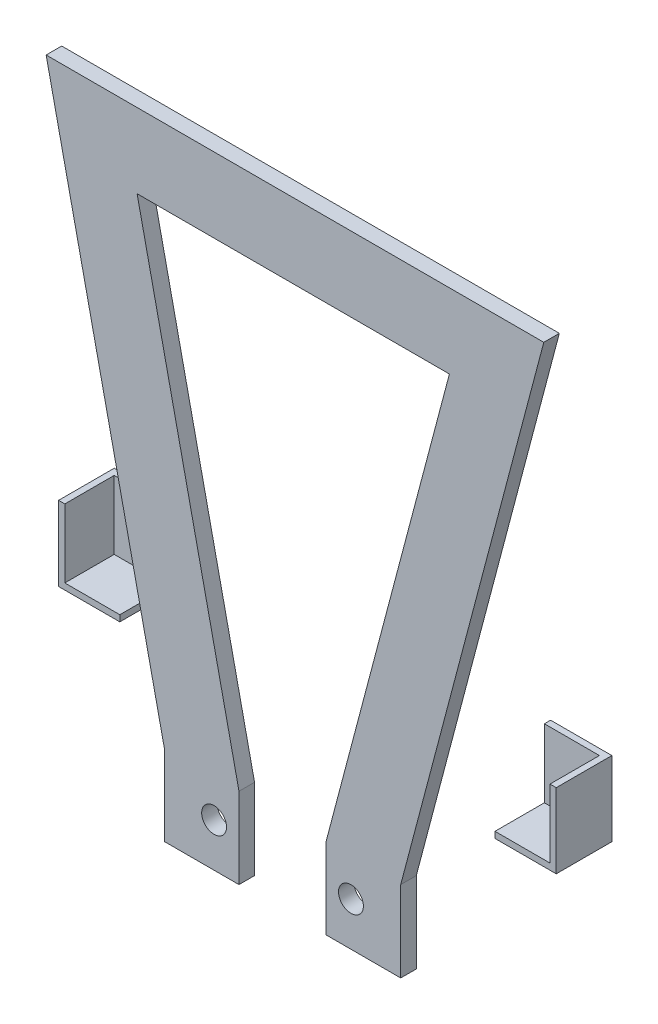
ISO-10303-21;
HEADER;
FILE_DESCRIPTION(('STEP AP214'),'2;1');
FILE_NAME('part.step','',(''),(''),'','','');
FILE_SCHEMA(('AUTOMOTIVE_DESIGN { 1 0 10303 214 1 1 1 1 }'));
ENDSEC;
DATA;
#1=APPLICATION_CONTEXT('core data for automotive mechanical design processes');
#2=APPLICATION_PROTOCOL_DEFINITION('international standard','automotive_design',2000,#1);
#3=PRODUCT_CONTEXT('',#1,'mechanical');
#4=PRODUCT('Part','Part','',(#3));
#5=PRODUCT_RELATED_PRODUCT_CATEGORY('part','',(#4));
#6=PRODUCT_DEFINITION_FORMATION('','',#4);
#7=PRODUCT_DEFINITION_CONTEXT('part definition',#1,'design');
#8=PRODUCT_DEFINITION('design','',#6,#7);
#9=PRODUCT_DEFINITION_SHAPE('','',#8);
#10=(LENGTH_UNIT() NAMED_UNIT(*) SI_UNIT(.MILLI.,.METRE.));
#11=(NAMED_UNIT(*) PLANE_ANGLE_UNIT() SI_UNIT($,.RADIAN.));
#12=(NAMED_UNIT(*) SI_UNIT($,.STERADIAN.) SOLID_ANGLE_UNIT());
#13=UNCERTAINTY_MEASURE_WITH_UNIT(LENGTH_MEASURE(1.E-05),#10,'distance_accuracy_value','');
#14=(GEOMETRIC_REPRESENTATION_CONTEXT(3) GLOBAL_UNCERTAINTY_ASSIGNED_CONTEXT((#13)) GLOBAL_UNIT_ASSIGNED_CONTEXT((#10,
#11,#12)) REPRESENTATION_CONTEXT('',''));
#15=CARTESIAN_POINT('',(0.,0.,0.));
#16=DIRECTION('',(0.,0.,1.));
#17=DIRECTION('',(1.,0.,0.));
#18=AXIS2_PLACEMENT_3D('',#15,#16,#17);
#19=CARTESIAN_POINT('',(-30.1533800378601,-30.,-2.));
#20=DIRECTION('',(1.,0.,0.));
#21=DIRECTION('',(0.,0.,1.));
#22=AXIS2_PLACEMENT_3D('',#19,#20,#21);
#23=PLANE('',#22);
#24=DIRECTION('',(0.,-1.,0.));
#25=VECTOR('',#24,1.);
#26=CARTESIAN_POINT('',(-30.1533800378601,-30.,-2.));
#27=LINE('',#26,#25);
#28=CARTESIAN_POINT('',(-30.1533800378601,-41.,-2.));
#29=VERTEX_POINT('',#28);
#30=CARTESIAN_POINT('',(-30.1533800378601,-42.,-2.));
#31=VERTEX_POINT('',#30);
#32=EDGE_CURVE('E159',#29,#31,#27,.T.);
#33=ORIENTED_EDGE('',*,*,#32,.T.);
#34=DIRECTION('',(0.,0.,-1.));
#35=VECTOR('',#34,1.);
#36=CARTESIAN_POINT('',(-30.1533800378601,-42.,-2.));
#37=LINE('',#36,#35);
#38=CARTESIAN_POINT('',(-30.1533800378601,-42.,-10.9421224629973));
#39=VERTEX_POINT('',#38);
#40=EDGE_CURVE('E153',#31,#39,#37,.T.);
#41=ORIENTED_EDGE('',*,*,#40,.T.);
#42=DIRECTION('',(0.,-1.,0.));
#43=VECTOR('',#42,1.);
#44=CARTESIAN_POINT('',(-30.1533800378601,-30.,-10.9421224629973));
#45=LINE('',#44,#43);
#46=CARTESIAN_POINT('',(-30.1533800378601,-30.,-10.9421224629973));
#47=VERTEX_POINT('',#46);
#48=EDGE_CURVE('E54',#47,#39,#45,.T.);
#49=ORIENTED_EDGE('',*,*,#48,.F.);
#50=DIRECTION('',(0.,0.,-1.));
#51=VECTOR('',#50,1.);
#52=CARTESIAN_POINT('',(-30.1533800378601,-30.,-2.));
#53=LINE('',#52,#51);
#54=CARTESIAN_POINT('',(-30.1533800378601,-30.,-9.9421224629973));
#55=VERTEX_POINT('',#54);
#56=EDGE_CURVE('E145',#55,#47,#53,.T.);
#57=ORIENTED_EDGE('',*,*,#56,.F.);
#58=DIRECTION('',(0.,-1.,0.));
#59=VECTOR('',#58,1.);
#60=CARTESIAN_POINT('',(-30.1533800378601,-30.,-9.9421224629973));
#61=LINE('',#60,#59);
#62=CARTESIAN_POINT('',(-30.1533800378601,-41.,-9.9421224629973));
#63=VERTEX_POINT('',#62);
#64=EDGE_CURVE('E126',#55,#63,#61,.T.);
#65=ORIENTED_EDGE('',*,*,#64,.T.);
#66=DIRECTION('',(0.,0.,-1.));
#67=VECTOR('',#66,1.);
#68=CARTESIAN_POINT('',(-30.1533800378601,-41.,-2.));
#69=LINE('',#68,#67);
#70=EDGE_CURVE('E118',#29,#63,#69,.T.);
#71=ORIENTED_EDGE('',*,*,#70,.F.);
#72=EDGE_LOOP('',(#33,#41,#49,#57,#65,#71));
#73=FACE_BOUND('',#72,.T.);
#74=ADVANCED_FACE('F46',(#73),#23,.T.);
#75=CARTESIAN_POINT('',(-40.,-30.,-2.));
#76=DIRECTION('',(0.,0.,1.));
#77=DIRECTION('',(-1.,0.,0.));
#78=AXIS2_PLACEMENT_3D('',#75,#76,#77);
#79=PLANE('',#78);
#80=DIRECTION('',(0.,-1.,0.));
#81=VECTOR('',#80,1.);
#82=CARTESIAN_POINT('',(-39.,-30.,-2.));
#83=LINE('',#82,#81);
#84=CARTESIAN_POINT('',(-39.,-30.,-2.));
#85=VERTEX_POINT('',#84);
#86=CARTESIAN_POINT('',(-39.,-41.,-2.));
#87=VERTEX_POINT('',#86);
#88=EDGE_CURVE('E131',#85,#87,#83,.T.);
#89=ORIENTED_EDGE('',*,*,#88,.F.);
#90=DIRECTION('',(1.,0.,0.));
#91=VECTOR('',#90,1.);
#92=CARTESIAN_POINT('',(-40.,-30.,-2.));
#93=LINE('',#92,#91);
#94=CARTESIAN_POINT('',(-40.,-30.,-2.));
#95=VERTEX_POINT('',#94);
#96=EDGE_CURVE('E147',#95,#85,#93,.T.);
#97=ORIENTED_EDGE('',*,*,#96,.F.);
#98=DIRECTION('',(0.,-1.,0.));
#99=VECTOR('',#98,1.);
#100=CARTESIAN_POINT('',(-40.,-30.,-2.));
#101=LINE('',#100,#99);
#102=CARTESIAN_POINT('',(-40.,-42.,-2.));
#103=VERTEX_POINT('',#102);
#104=EDGE_CURVE('E149',#95,#103,#101,.T.);
#105=ORIENTED_EDGE('',*,*,#104,.T.);
#106=DIRECTION('',(1.,0.,0.));
#107=VECTOR('',#106,1.);
#108=CARTESIAN_POINT('',(-40.,-42.,-2.));
#109=LINE('',#108,#107);
#110=EDGE_CURVE('E143',#103,#31,#109,.T.);
#111=ORIENTED_EDGE('',*,*,#110,.T.);
#112=ORIENTED_EDGE('',*,*,#32,.F.);
#113=DIRECTION('',(1.,0.,0.));
#114=VECTOR('',#113,1.);
#115=CARTESIAN_POINT('',(-40.,-41.,-2.));
#116=LINE('',#115,#114);
#117=EDGE_CURVE('E136',#87,#29,#116,.T.);
#118=ORIENTED_EDGE('',*,*,#117,.F.);
#119=EDGE_LOOP('',(#89,#97,#105,#111,#112,#118));
#120=FACE_BOUND('',#119,.T.);
#121=ADVANCED_FACE('F173',(#120),#79,.T.);
#122=CARTESIAN_POINT('',(-40.,-30.,-2.));
#123=DIRECTION('',(1.,0.,0.));
#124=DIRECTION('',(0.,0.,1.));
#125=AXIS2_PLACEMENT_3D('',#122,#123,#124);
#126=PLANE('',#125);
#127=DIRECTION('',(0.,0.,-1.));
#128=VECTOR('',#127,1.);
#129=CARTESIAN_POINT('',(-40.,-42.,-2.));
#130=LINE('',#129,#128);
#131=CARTESIAN_POINT('',(-40.,-42.,-10.9421224629973));
#132=VERTEX_POINT('',#131);
#133=EDGE_CURVE('E90',#103,#132,#130,.T.);
#134=ORIENTED_EDGE('',*,*,#133,.F.);
#135=ORIENTED_EDGE('',*,*,#104,.F.);
#136=DIRECTION('',(0.,0.,-1.));
#137=VECTOR('',#136,1.);
#138=CARTESIAN_POINT('',(-40.,-30.,-2.));
#139=LINE('',#138,#137);
#140=CARTESIAN_POINT('',(-40.,-30.,-10.9421224629973));
#141=VERTEX_POINT('',#140);
#142=EDGE_CURVE('E70',#95,#141,#139,.T.);
#143=ORIENTED_EDGE('',*,*,#142,.T.);
#144=DIRECTION('',(0.,-1.,0.));
#145=VECTOR('',#144,1.);
#146=CARTESIAN_POINT('',(-40.,-30.,-10.9421224629973));
#147=LINE('',#146,#145);
#148=EDGE_CURVE('E12',#141,#132,#147,.T.);
#149=ORIENTED_EDGE('',*,*,#148,.T.);
#150=EDGE_LOOP('',(#134,#135,#143,#149));
#151=FACE_BOUND('',#150,.T.);
#152=ADVANCED_FACE('F48',(#151),#126,.F.);
#153=CARTESIAN_POINT('',(-40.,-30.,-10.9421224629973));
#154=DIRECTION('',(0.,0.,1.));
#155=DIRECTION('',(-1.,0.,0.));
#156=AXIS2_PLACEMENT_3D('',#153,#154,#155);
#157=PLANE('',#156);
#158=DIRECTION('',(1.,0.,0.));
#159=VECTOR('',#158,1.);
#160=CARTESIAN_POINT('',(-40.,-42.,-10.9421224629973));
#161=LINE('',#160,#159);
#162=EDGE_CURVE('E151',#132,#39,#161,.T.);
#163=ORIENTED_EDGE('',*,*,#162,.F.);
#164=ORIENTED_EDGE('',*,*,#148,.F.);
#165=DIRECTION('',(1.,0.,0.));
#166=VECTOR('',#165,1.);
#167=CARTESIAN_POINT('',(-40.,-30.,-10.9421224629973));
#168=LINE('',#167,#166);
#169=EDGE_CURVE('E93',#141,#47,#168,.T.);
#170=ORIENTED_EDGE('',*,*,#169,.T.);
#171=ORIENTED_EDGE('',*,*,#48,.T.);
#172=EDGE_LOOP('',(#163,#164,#170,#171));
#173=FACE_BOUND('',#172,.T.);
#174=ADVANCED_FACE('F164',(#173),#157,.F.);
#175=CARTESIAN_POINT('',(0.,-30.,0.));
#176=DIRECTION('',(0.,1.,0.));
#177=DIRECTION('',(0.,0.,1.));
#178=AXIS2_PLACEMENT_3D('',#175,#176,#177);
#179=PLANE('',#178);
#180=DIRECTION('',(0.,0.,-1.));
#181=VECTOR('',#180,1.);
#182=CARTESIAN_POINT('',(-39.,-30.,-2.));
#183=LINE('',#182,#181);
#184=CARTESIAN_POINT('',(-39.,-30.,-9.9421224629973));
#185=VERTEX_POINT('',#184);
#186=EDGE_CURVE('E134',#85,#185,#183,.T.);
#187=ORIENTED_EDGE('',*,*,#186,.T.);
#188=DIRECTION('',(1.,0.,0.));
#189=VECTOR('',#188,1.);
#190=CARTESIAN_POINT('',(-40.,-30.,-9.9421224629973));
#191=LINE('',#190,#189);
#192=EDGE_CURVE('E124',#185,#55,#191,.T.);
#193=ORIENTED_EDGE('',*,*,#192,.T.);
#194=ORIENTED_EDGE('',*,*,#56,.T.);
#195=ORIENTED_EDGE('',*,*,#169,.F.);
#196=ORIENTED_EDGE('',*,*,#142,.F.);
#197=ORIENTED_EDGE('',*,*,#96,.T.);
#198=EDGE_LOOP('',(#187,#193,#194,#195,#196,#197));
#199=FACE_BOUND('',#198,.T.);
#200=ADVANCED_FACE('F179',(#199),#179,.T.);
#201=CARTESIAN_POINT('',(0.,-42.,0.));
#202=DIRECTION('',(0.,1.,0.));
#203=DIRECTION('',(0.,0.,1.));
#204=AXIS2_PLACEMENT_3D('',#201,#202,#203);
#205=PLANE('',#204);
#206=ORIENTED_EDGE('',*,*,#133,.T.);
#207=ORIENTED_EDGE('',*,*,#162,.T.);
#208=ORIENTED_EDGE('',*,*,#40,.F.);
#209=ORIENTED_EDGE('',*,*,#110,.F.);
#210=EDGE_LOOP('',(#206,#207,#208,#209));
#211=FACE_BOUND('',#210,.T.);
#212=ADVANCED_FACE('F170',(#211),#205,.F.);
#213=CARTESIAN_POINT('',(-39.,-30.,-2.));
#214=DIRECTION('',(1.,0.,0.));
#215=DIRECTION('',(0.,0.,1.));
#216=AXIS2_PLACEMENT_3D('',#213,#214,#215);
#217=PLANE('',#216);
#218=DIRECTION('',(0.,0.,-1.));
#219=VECTOR('',#218,1.);
#220=CARTESIAN_POINT('',(-39.,-41.,-2.));
#221=LINE('',#220,#219);
#222=CARTESIAN_POINT('',(-39.,-41.,-9.9421224629973));
#223=VERTEX_POINT('',#222);
#224=EDGE_CURVE('E115',#87,#223,#221,.T.);
#225=ORIENTED_EDGE('',*,*,#224,.T.);
#226=DIRECTION('',(0.,-1.,0.));
#227=VECTOR('',#226,1.);
#228=CARTESIAN_POINT('',(-39.,-30.,-9.9421224629973));
#229=LINE('',#228,#227);
#230=EDGE_CURVE('E61',#185,#223,#229,.T.);
#231=ORIENTED_EDGE('',*,*,#230,.F.);
#232=ORIENTED_EDGE('',*,*,#186,.F.);
#233=ORIENTED_EDGE('',*,*,#88,.T.);
#234=EDGE_LOOP('',(#225,#231,#232,#233));
#235=FACE_BOUND('',#234,.T.);
#236=ADVANCED_FACE('F129',(#235),#217,.T.);
#237=CARTESIAN_POINT('',(-40.,-30.,-9.9421224629973));
#238=DIRECTION('',(0.,0.,1.));
#239=DIRECTION('',(-1.,0.,0.));
#240=AXIS2_PLACEMENT_3D('',#237,#238,#239);
#241=PLANE('',#240);
#242=DIRECTION('',(1.,0.,0.));
#243=VECTOR('',#242,1.);
#244=CARTESIAN_POINT('',(-40.,-41.,-9.9421224629973));
#245=LINE('',#244,#243);
#246=EDGE_CURVE('E113',#223,#63,#245,.T.);
#247=ORIENTED_EDGE('',*,*,#246,.T.);
#248=ORIENTED_EDGE('',*,*,#64,.F.);
#249=ORIENTED_EDGE('',*,*,#192,.F.);
#250=ORIENTED_EDGE('',*,*,#230,.T.);
#251=EDGE_LOOP('',(#247,#248,#249,#250));
#252=FACE_BOUND('',#251,.T.);
#253=ADVANCED_FACE('F123',(#252),#241,.T.);
#254=CARTESIAN_POINT('',(0.,-41.,0.));
#255=DIRECTION('',(0.,1.,0.));
#256=DIRECTION('',(0.,0.,1.));
#257=AXIS2_PLACEMENT_3D('',#254,#255,#256);
#258=PLANE('',#257);
#259=ORIENTED_EDGE('',*,*,#224,.F.);
#260=ORIENTED_EDGE('',*,*,#117,.T.);
#261=ORIENTED_EDGE('',*,*,#70,.T.);
#262=ORIENTED_EDGE('',*,*,#246,.F.);
#263=EDGE_LOOP('',(#259,#260,#261,#262));
#264=FACE_BOUND('',#263,.T.);
#265=ADVANCED_FACE('F114',(#264),#258,.T.);
#266=CLOSED_SHELL('',(#74,#121,#152,#174,#200,#212,#236,#253,#265));
#267=MANIFOLD_SOLID_BREP('B2',#266);
#268=CARTESIAN_POINT('',(30.1533800378601,-30.,-2.));
#269=DIRECTION('',(-1.,0.,0.));
#270=DIRECTION('',(0.,0.,1.));
#271=AXIS2_PLACEMENT_3D('',#268,#269,#270);
#272=PLANE('',#271);
#273=DIRECTION('',(0.,-1.,0.));
#274=VECTOR('',#273,1.);
#275=CARTESIAN_POINT('',(30.1533800378601,-30.,-2.));
#276=LINE('',#275,#274);
#277=CARTESIAN_POINT('',(30.1533800378601,-41.,-2.));
#278=VERTEX_POINT('',#277);
#279=CARTESIAN_POINT('',(30.1533800378601,-42.,-2.));
#280=VERTEX_POINT('',#279);
#281=EDGE_CURVE('E373',#278,#280,#276,.T.);
#282=ORIENTED_EDGE('',*,*,#281,.F.);
#283=DIRECTION('',(0.,0.,-1.));
#284=VECTOR('',#283,1.);
#285=CARTESIAN_POINT('',(30.1533800378601,-41.,-2.));
#286=LINE('',#285,#284);
#287=CARTESIAN_POINT('',(30.1533800378601,-41.,-9.9421224629973));
#288=VERTEX_POINT('',#287);
#289=EDGE_CURVE('E330',#278,#288,#286,.T.);
#290=ORIENTED_EDGE('',*,*,#289,.T.);
#291=DIRECTION('',(0.,-1.,0.));
#292=VECTOR('',#291,1.);
#293=CARTESIAN_POINT('',(30.1533800378601,-30.,-9.9421224629973));
#294=LINE('',#293,#292);
#295=CARTESIAN_POINT('',(30.1533800378601,-30.,-9.9421224629973));
#296=VERTEX_POINT('',#295);
#297=EDGE_CURVE('E326',#296,#288,#294,.T.);
#298=ORIENTED_EDGE('',*,*,#297,.F.);
#299=DIRECTION('',(0.,0.,-1.));
#300=VECTOR('',#299,1.);
#301=CARTESIAN_POINT('',(30.1533800378601,-30.,-2.));
#302=LINE('',#301,#300);
#303=CARTESIAN_POINT('',(30.1533800378601,-30.,-10.9421224629973));
#304=VERTEX_POINT('',#303);
#305=EDGE_CURVE('E359',#296,#304,#302,.T.);
#306=ORIENTED_EDGE('',*,*,#305,.T.);
#307=DIRECTION('',(0.,-1.,0.));
#308=VECTOR('',#307,1.);
#309=CARTESIAN_POINT('',(30.1533800378601,-30.,-10.9421224629973));
#310=LINE('',#309,#308);
#311=CARTESIAN_POINT('',(30.1533800378601,-42.,-10.9421224629973));
#312=VERTEX_POINT('',#311);
#313=EDGE_CURVE('E265',#304,#312,#310,.T.);
#314=ORIENTED_EDGE('',*,*,#313,.T.);
#315=DIRECTION('',(0.,0.,-1.));
#316=VECTOR('',#315,1.);
#317=CARTESIAN_POINT('',(30.1533800378601,-42.,-2.));
#318=LINE('',#317,#316);
#319=EDGE_CURVE('E367',#280,#312,#318,.T.);
#320=ORIENTED_EDGE('',*,*,#319,.F.);
#321=EDGE_LOOP('',(#282,#290,#298,#306,#314,#320));
#322=FACE_BOUND('',#321,.T.);
#323=ADVANCED_FACE('F257',(#322),#272,.T.);
#324=CARTESIAN_POINT('',(40.,-30.,-2.));
#325=DIRECTION('',(0.,0.,1.));
#326=DIRECTION('',(1.,0.,0.));
#327=AXIS2_PLACEMENT_3D('',#324,#325,#326);
#328=PLANE('',#327);
#329=DIRECTION('',(0.,-1.,0.));
#330=VECTOR('',#329,1.);
#331=CARTESIAN_POINT('',(39.,-30.,-2.));
#332=LINE('',#331,#330);
#333=CARTESIAN_POINT('',(39.,-30.,-2.));
#334=VERTEX_POINT('',#333);
#335=CARTESIAN_POINT('',(39.,-41.,-2.));
#336=VERTEX_POINT('',#335);
#337=EDGE_CURVE('E350',#334,#336,#332,.T.);
#338=ORIENTED_EDGE('',*,*,#337,.T.);
#339=DIRECTION('',(-1.,0.,0.));
#340=VECTOR('',#339,1.);
#341=CARTESIAN_POINT('',(40.,-41.,-2.));
#342=LINE('',#341,#340);
#343=EDGE_CURVE('E343',#336,#278,#342,.T.);
#344=ORIENTED_EDGE('',*,*,#343,.T.);
#345=ORIENTED_EDGE('',*,*,#281,.T.);
#346=DIRECTION('',(-1.,0.,0.));
#347=VECTOR('',#346,1.);
#348=CARTESIAN_POINT('',(40.,-42.,-2.));
#349=LINE('',#348,#347);
#350=CARTESIAN_POINT('',(40.,-42.,-2.));
#351=VERTEX_POINT('',#350);
#352=EDGE_CURVE('E357',#351,#280,#349,.T.);
#353=ORIENTED_EDGE('',*,*,#352,.F.);
#354=DIRECTION('',(0.,-1.,0.));
#355=VECTOR('',#354,1.);
#356=CARTESIAN_POINT('',(40.,-30.,-2.));
#357=LINE('',#356,#355);
#358=CARTESIAN_POINT('',(40.,-30.,-2.));
#359=VERTEX_POINT('',#358);
#360=EDGE_CURVE('E281',#359,#351,#357,.T.);
#361=ORIENTED_EDGE('',*,*,#360,.F.);
#362=DIRECTION('',(-1.,0.,0.));
#363=VECTOR('',#362,1.);
#364=CARTESIAN_POINT('',(40.,-30.,-2.));
#365=LINE('',#364,#363);
#366=EDGE_CURVE('E361',#359,#334,#365,.T.);
#367=ORIENTED_EDGE('',*,*,#366,.T.);
#368=EDGE_LOOP('',(#338,#344,#345,#353,#361,#367));
#369=FACE_BOUND('',#368,.T.);
#370=ADVANCED_FACE('F382',(#369),#328,.T.);
#371=CARTESIAN_POINT('',(40.,-30.,-2.));
#372=DIRECTION('',(-1.,0.,0.));
#373=DIRECTION('',(0.,0.,1.));
#374=AXIS2_PLACEMENT_3D('',#371,#372,#373);
#375=PLANE('',#374);
#376=DIRECTION('',(0.,0.,-1.));
#377=VECTOR('',#376,1.);
#378=CARTESIAN_POINT('',(40.,-42.,-2.));
#379=LINE('',#378,#377);
#380=CARTESIAN_POINT('',(40.,-42.,-10.9421224629973));
#381=VERTEX_POINT('',#380);
#382=EDGE_CURVE('E339',#351,#381,#379,.T.);
#383=ORIENTED_EDGE('',*,*,#382,.T.);
#384=DIRECTION('',(0.,-1.,0.));
#385=VECTOR('',#384,1.);
#386=CARTESIAN_POINT('',(40.,-30.,-10.9421224629973));
#387=LINE('',#386,#385);
#388=CARTESIAN_POINT('',(40.,-30.,-10.9421224629973));
#389=VERTEX_POINT('',#388);
#390=EDGE_CURVE('E44',#389,#381,#387,.T.);
#391=ORIENTED_EDGE('',*,*,#390,.F.);
#392=DIRECTION('',(0.,0.,-1.));
#393=VECTOR('',#392,1.);
#394=CARTESIAN_POINT('',(40.,-30.,-2.));
#395=LINE('',#394,#393);
#396=EDGE_CURVE('E355',#359,#389,#395,.T.);
#397=ORIENTED_EDGE('',*,*,#396,.F.);
#398=ORIENTED_EDGE('',*,*,#360,.T.);
#399=EDGE_LOOP('',(#383,#391,#397,#398));
#400=FACE_BOUND('',#399,.T.);
#401=ADVANCED_FACE('F259',(#400),#375,.F.);
#402=CARTESIAN_POINT('',(40.,-30.,-10.9421224629973));
#403=DIRECTION('',(0.,0.,1.));
#404=DIRECTION('',(1.,0.,0.));
#405=AXIS2_PLACEMENT_3D('',#402,#403,#404);
#406=PLANE('',#405);
#407=DIRECTION('',(-1.,0.,0.));
#408=VECTOR('',#407,1.);
#409=CARTESIAN_POINT('',(40.,-42.,-10.9421224629973));
#410=LINE('',#409,#408);
#411=EDGE_CURVE('E364',#381,#312,#410,.T.);
#412=ORIENTED_EDGE('',*,*,#411,.T.);
#413=ORIENTED_EDGE('',*,*,#313,.F.);
#414=DIRECTION('',(-1.,0.,0.));
#415=VECTOR('',#414,1.);
#416=CARTESIAN_POINT('',(40.,-30.,-10.9421224629973));
#417=LINE('',#416,#415);
#418=EDGE_CURVE('E305',#389,#304,#417,.T.);
#419=ORIENTED_EDGE('',*,*,#418,.F.);
#420=ORIENTED_EDGE('',*,*,#390,.T.);
#421=EDGE_LOOP('',(#412,#413,#419,#420));
#422=FACE_BOUND('',#421,.T.);
#423=ADVANCED_FACE('F378',(#422),#406,.F.);
#424=CARTESIAN_POINT('',(0.,-30.,0.));
#425=DIRECTION('',(0.,1.,0.));
#426=DIRECTION('',(0.,0.,1.));
#427=AXIS2_PLACEMENT_3D('',#424,#425,#426);
#428=PLANE('',#427);
#429=DIRECTION('',(0.,0.,-1.));
#430=VECTOR('',#429,1.);
#431=CARTESIAN_POINT('',(39.,-30.,-2.));
#432=LINE('',#431,#430);
#433=CARTESIAN_POINT('',(39.,-30.,-9.9421224629973));
#434=VERTEX_POINT('',#433);
#435=EDGE_CURVE('E337',#334,#434,#432,.T.);
#436=ORIENTED_EDGE('',*,*,#435,.F.);
#437=ORIENTED_EDGE('',*,*,#366,.F.);
#438=ORIENTED_EDGE('',*,*,#396,.T.);
#439=ORIENTED_EDGE('',*,*,#418,.T.);
#440=ORIENTED_EDGE('',*,*,#305,.F.);
#441=DIRECTION('',(-1.,0.,0.));
#442=VECTOR('',#441,1.);
#443=CARTESIAN_POINT('',(40.,-30.,-9.9421224629973));
#444=LINE('',#443,#442);
#445=EDGE_CURVE('E348',#434,#296,#444,.T.);
#446=ORIENTED_EDGE('',*,*,#445,.F.);
#447=EDGE_LOOP('',(#436,#437,#438,#439,#440,#446));
#448=FACE_BOUND('',#447,.T.);
#449=ADVANCED_FACE('F384',(#448),#428,.T.);
#450=CARTESIAN_POINT('',(0.,-42.,0.));
#451=DIRECTION('',(0.,1.,0.));
#452=DIRECTION('',(0.,0.,1.));
#453=AXIS2_PLACEMENT_3D('',#450,#451,#452);
#454=PLANE('',#453);
#455=ORIENTED_EDGE('',*,*,#382,.F.);
#456=ORIENTED_EDGE('',*,*,#352,.T.);
#457=ORIENTED_EDGE('',*,*,#319,.T.);
#458=ORIENTED_EDGE('',*,*,#411,.F.);
#459=EDGE_LOOP('',(#455,#456,#457,#458));
#460=FACE_BOUND('',#459,.T.);
#461=ADVANCED_FACE('F381',(#460),#454,.F.);
#462=CARTESIAN_POINT('',(39.,-30.,-2.));
#463=DIRECTION('',(-1.,0.,0.));
#464=DIRECTION('',(0.,0.,1.));
#465=AXIS2_PLACEMENT_3D('',#462,#463,#464);
#466=PLANE('',#465);
#467=DIRECTION('',(0.,0.,-1.));
#468=VECTOR('',#467,1.);
#469=CARTESIAN_POINT('',(39.,-41.,-2.));
#470=LINE('',#469,#468);
#471=CARTESIAN_POINT('',(39.,-41.,-9.9421224629973));
#472=VERTEX_POINT('',#471);
#473=EDGE_CURVE('E331',#336,#472,#470,.T.);
#474=ORIENTED_EDGE('',*,*,#473,.F.);
#475=ORIENTED_EDGE('',*,*,#337,.F.);
#476=ORIENTED_EDGE('',*,*,#435,.T.);
#477=DIRECTION('',(0.,-1.,0.));
#478=VECTOR('',#477,1.);
#479=CARTESIAN_POINT('',(39.,-30.,-9.9421224629973));
#480=LINE('',#479,#478);
#481=EDGE_CURVE('E272',#434,#472,#480,.T.);
#482=ORIENTED_EDGE('',*,*,#481,.T.);
#483=EDGE_LOOP('',(#474,#475,#476,#482));
#484=FACE_BOUND('',#483,.T.);
#485=ADVANCED_FACE('F334',(#484),#466,.T.);
#486=CARTESIAN_POINT('',(40.,-30.,-9.9421224629973));
#487=DIRECTION('',(0.,0.,1.));
#488=DIRECTION('',(1.,0.,0.));
#489=AXIS2_PLACEMENT_3D('',#486,#487,#488);
#490=PLANE('',#489);
#491=DIRECTION('',(-1.,0.,0.));
#492=VECTOR('',#491,1.);
#493=CARTESIAN_POINT('',(40.,-41.,-9.9421224629973));
#494=LINE('',#493,#492);
#495=EDGE_CURVE('E323',#472,#288,#494,.T.);
#496=ORIENTED_EDGE('',*,*,#495,.F.);
#497=ORIENTED_EDGE('',*,*,#481,.F.);
#498=ORIENTED_EDGE('',*,*,#445,.T.);
#499=ORIENTED_EDGE('',*,*,#297,.T.);
#500=EDGE_LOOP('',(#496,#497,#498,#499));
#501=FACE_BOUND('',#500,.T.);
#502=ADVANCED_FACE('F324',(#501),#490,.T.);
#503=CARTESIAN_POINT('',(0.,-41.,0.));
#504=DIRECTION('',(0.,1.,0.));
#505=DIRECTION('',(0.,0.,1.));
#506=AXIS2_PLACEMENT_3D('',#503,#504,#505);
#507=PLANE('',#506);
#508=ORIENTED_EDGE('',*,*,#473,.T.);
#509=ORIENTED_EDGE('',*,*,#495,.T.);
#510=ORIENTED_EDGE('',*,*,#289,.F.);
#511=ORIENTED_EDGE('',*,*,#343,.F.);
#512=EDGE_LOOP('',(#508,#509,#510,#511));
#513=FACE_BOUND('',#512,.T.);
#514=ADVANCED_FACE('F341',(#513),#507,.T.);
#515=CLOSED_SHELL('',(#323,#370,#401,#423,#449,#461,#485,#502,#514));
#516=MANIFOLD_SOLID_BREP('B6',#515);
#517=CARTESIAN_POINT('',(17.,-67.,0.));
#518=DIRECTION('',(0.,-1.,0.));
#519=DIRECTION('',(0.,0.,-1.));
#520=AXIS2_PLACEMENT_3D('',#517,#518,#519);
#521=PLANE('',#520);
#522=DIRECTION('',(0.,0.,1.));
#523=VECTOR('',#522,1.);
#524=CARTESIAN_POINT('',(-9.,-67.,-2.5));
#525=LINE('',#524,#523);
#526=CARTESIAN_POINT('',(-9.,-67.,-2.5));
#527=VERTEX_POINT('',#526);
#528=CARTESIAN_POINT('',(-9.,-67.,0.));
#529=VERTEX_POINT('',#528);
#530=EDGE_CURVE('E622',#527,#529,#525,.T.);
#531=ORIENTED_EDGE('',*,*,#530,.T.);
#532=DIRECTION('',(-1.,0.,0.));
#533=VECTOR('',#532,1.);
#534=CARTESIAN_POINT('',(17.,-67.,0.));
#535=LINE('',#534,#533);
#536=CARTESIAN_POINT('',(-21.,-67.,0.));
#537=VERTEX_POINT('',#536);
#538=EDGE_CURVE('E555',#529,#537,#535,.T.);
#539=ORIENTED_EDGE('',*,*,#538,.T.);
#540=DIRECTION('',(0.,0.,-1.));
#541=VECTOR('',#540,1.);
#542=CARTESIAN_POINT('',(-21.,-67.,0.));
#543=LINE('',#542,#541);
#544=CARTESIAN_POINT('',(-21.,-67.,-2.5));
#545=VERTEX_POINT('',#544);
#546=EDGE_CURVE('E540',#537,#545,#543,.T.);
#547=ORIENTED_EDGE('',*,*,#546,.T.);
#548=DIRECTION('',(-1.,0.,0.));
#549=VECTOR('',#548,1.);
#550=CARTESIAN_POINT('',(17.,-67.,-2.5));
#551=LINE('',#550,#549);
#552=EDGE_CURVE('E567',#527,#545,#551,.T.);
#553=ORIENTED_EDGE('',*,*,#552,.F.);
#554=EDGE_LOOP('',(#531,#539,#547,#553));
#555=FACE_BOUND('',#554,.T.);
#556=ADVANCED_FACE('F459',(#555),#521,.T.);
#557=CARTESIAN_POINT('',(40.,33.,0.));
#558=DIRECTION('',(0.966786030335291,-0.25558711146795,0.));
#559=DIRECTION('',(0.25558711146795,0.966786030335291,0.));
#560=AXIS2_PLACEMENT_3D('',#557,#558,#559);
#561=PLANE('',#560);
#562=DIRECTION('',(-0.25558711146795,-0.966786030335291,0.));
#563=VECTOR('',#562,1.);
#564=CARTESIAN_POINT('',(40.,33.,-2.5));
#565=LINE('',#564,#563);
#566=CARTESIAN_POINT('',(40.,33.,-2.5));
#567=VERTEX_POINT('',#566);
#568=CARTESIAN_POINT('',(17.,-54.,-2.5));
#569=VERTEX_POINT('',#568);
#570=EDGE_CURVE('E560',#567,#569,#565,.T.);
#571=ORIENTED_EDGE('',*,*,#570,.F.);
#572=DIRECTION('',(0.,0.,-1.));
#573=VECTOR('',#572,1.);
#574=CARTESIAN_POINT('',(40.,33.,0.));
#575=LINE('',#574,#573);
#576=CARTESIAN_POINT('',(40.,33.,0.));
#577=VERTEX_POINT('',#576);
#578=EDGE_CURVE('E255',#577,#567,#575,.T.);
#579=ORIENTED_EDGE('',*,*,#578,.F.);
#580=DIRECTION('',(-0.25558711146795,-0.966786030335291,0.));
#581=VECTOR('',#580,1.);
#582=CARTESIAN_POINT('',(40.,33.,0.));
#583=LINE('',#582,#581);
#584=CARTESIAN_POINT('',(17.,-54.,0.));
#585=VERTEX_POINT('',#584);
#586=EDGE_CURVE('E576',#577,#585,#583,.T.);
#587=ORIENTED_EDGE('',*,*,#586,.T.);
#588=DIRECTION('',(0.,0.,-1.));
#589=VECTOR('',#588,1.);
#590=CARTESIAN_POINT('',(17.,-54.,0.));
#591=LINE('',#590,#589);
#592=EDGE_CURVE('E463',#585,#569,#591,.T.);
#593=ORIENTED_EDGE('',*,*,#592,.T.);
#594=EDGE_LOOP('',(#571,#579,#587,#593));
#595=FACE_BOUND('',#594,.T.);
#596=ADVANCED_FACE('F461',(#595),#561,.T.);
#597=CARTESIAN_POINT('',(-40.,33.,0.));
#598=DIRECTION('',(0.,1.,0.));
#599=DIRECTION('',(0.,0.,1.));
#600=AXIS2_PLACEMENT_3D('',#597,#598,#599);
#601=PLANE('',#600);
#602=DIRECTION('',(1.,0.,0.));
#603=VECTOR('',#602,1.);
#604=CARTESIAN_POINT('',(-40.,33.,-2.5));
#605=LINE('',#604,#603);
#606=CARTESIAN_POINT('',(-40.,33.,-2.5));
#607=VERTEX_POINT('',#606);
#608=EDGE_CURVE('E574',#607,#567,#605,.T.);
#609=ORIENTED_EDGE('',*,*,#608,.F.);
#610=DIRECTION('',(0.,0.,-1.));
#611=VECTOR('',#610,1.);
#612=CARTESIAN_POINT('',(-40.,33.,0.));
#613=LINE('',#612,#611);
#614=CARTESIAN_POINT('',(-40.,33.,0.));
#615=VERTEX_POINT('',#614);
#616=EDGE_CURVE('E468',#615,#607,#613,.T.);
#617=ORIENTED_EDGE('',*,*,#616,.F.);
#618=DIRECTION('',(1.,0.,0.));
#619=VECTOR('',#618,1.);
#620=CARTESIAN_POINT('',(-40.,33.,0.));
#621=LINE('',#620,#619);
#622=EDGE_CURVE('E547',#615,#577,#621,.T.);
#623=ORIENTED_EDGE('',*,*,#622,.T.);
#624=ORIENTED_EDGE('',*,*,#578,.T.);
#625=EDGE_LOOP('',(#609,#617,#623,#624));
#626=FACE_BOUND('',#625,.T.);
#627=ADVANCED_FACE('F585',(#626),#601,.T.);
#628=CARTESIAN_POINT('',(-21.,-54.,0.));
#629=DIRECTION('',(-0.97697321911612,-0.213361967393176,0.));
#630=DIRECTION('',(0.213361967393176,-0.97697321911612,0.));
#631=AXIS2_PLACEMENT_3D('',#628,#629,#630);
#632=PLANE('',#631);
#633=DIRECTION('',(-0.213361967393176,0.97697321911612,0.));
#634=VECTOR('',#633,1.);
#635=CARTESIAN_POINT('',(-21.,-54.,-2.5));
#636=LINE('',#635,#634);
#637=CARTESIAN_POINT('',(-21.,-54.,-2.5));
#638=VERTEX_POINT('',#637);
#639=EDGE_CURVE('E535',#638,#607,#636,.T.);
#640=ORIENTED_EDGE('',*,*,#639,.F.);
#641=DIRECTION('',(0.,0.,-1.));
#642=VECTOR('',#641,1.);
#643=CARTESIAN_POINT('',(-21.,-54.,0.));
#644=LINE('',#643,#642);
#645=CARTESIAN_POINT('',(-21.,-54.,0.));
#646=VERTEX_POINT('',#645);
#647=EDGE_CURVE('E529',#646,#638,#644,.T.);
#648=ORIENTED_EDGE('',*,*,#647,.F.);
#649=DIRECTION('',(-0.213361967393176,0.97697321911612,0.));
#650=VECTOR('',#649,1.);
#651=CARTESIAN_POINT('',(-21.,-54.,0.));
#652=LINE('',#651,#650);
#653=EDGE_CURVE('E532',#646,#615,#652,.T.);
#654=ORIENTED_EDGE('',*,*,#653,.T.);
#655=ORIENTED_EDGE('',*,*,#616,.T.);
#656=EDGE_LOOP('',(#640,#648,#654,#655));
#657=FACE_BOUND('',#656,.T.);
#658=ADVANCED_FACE('F531',(#657),#632,.T.);
#659=CARTESIAN_POINT('',(-21.,-67.,0.));
#660=DIRECTION('',(-1.,0.,0.));
#661=DIRECTION('',(0.,0.,1.));
#662=AXIS2_PLACEMENT_3D('',#659,#660,#661);
#663=PLANE('',#662);
#664=DIRECTION('',(0.,1.,0.));
#665=VECTOR('',#664,1.);
#666=CARTESIAN_POINT('',(-21.,-67.,-2.5));
#667=LINE('',#666,#665);
#668=EDGE_CURVE('E571',#545,#638,#667,.T.);
#669=ORIENTED_EDGE('',*,*,#668,.F.);
#670=ORIENTED_EDGE('',*,*,#546,.F.);
#671=DIRECTION('',(0.,1.,0.));
#672=VECTOR('',#671,1.);
#673=CARTESIAN_POINT('',(-21.,-67.,0.));
#674=LINE('',#673,#672);
#675=EDGE_CURVE('E546',#537,#646,#674,.T.);
#676=ORIENTED_EDGE('',*,*,#675,.T.);
#677=ORIENTED_EDGE('',*,*,#647,.T.);
#678=EDGE_LOOP('',(#669,#670,#676,#677));
#679=FACE_BOUND('',#678,.T.);
#680=ADVANCED_FACE('F550',(#679),#663,.T.);
#681=DIRECTION('',(0.,0.,1.));
#682=VECTOR('',#681,1.);
#683=CARTESIAN_POINT('',(5.,-67.,-2.5));
#684=LINE('',#683,#682);
#685=CARTESIAN_POINT('',(5.,-67.,-2.5));
#686=VERTEX_POINT('',#685);
#687=CARTESIAN_POINT('',(5.,-67.,0.));
#688=VERTEX_POINT('',#687);
#689=EDGE_CURVE('E611',#686,#688,#684,.T.);
#690=ORIENTED_EDGE('',*,*,#689,.F.);
#691=CARTESIAN_POINT('',(17.,-67.,-2.5));
#692=VERTEX_POINT('',#691);
#693=EDGE_CURVE('E568',#692,#686,#551,.T.);
#694=ORIENTED_EDGE('',*,*,#693,.F.);
#695=DIRECTION('',(0.,0.,-1.));
#696=VECTOR('',#695,1.);
#697=CARTESIAN_POINT('',(17.,-67.,0.));
#698=LINE('',#697,#696);
#699=CARTESIAN_POINT('',(17.,-67.,0.));
#700=VERTEX_POINT('',#699);
#701=EDGE_CURVE('E579',#700,#692,#698,.T.);
#702=ORIENTED_EDGE('',*,*,#701,.F.);
#703=EDGE_CURVE('E552',#700,#688,#535,.T.);
#704=ORIENTED_EDGE('',*,*,#703,.T.);
#705=EDGE_LOOP('',(#690,#694,#702,#704));
#706=FACE_BOUND('',#705,.T.);
#707=ADVANCED_FACE('F597',(#706),#521,.T.);
#708=CARTESIAN_POINT('',(17.,-54.,0.));
#709=DIRECTION('',(1.,0.,0.));
#710=DIRECTION('',(0.,0.,-1.));
#711=AXIS2_PLACEMENT_3D('',#708,#709,#710);
#712=PLANE('',#711);
#713=DIRECTION('',(0.,-1.,0.));
#714=VECTOR('',#713,1.);
#715=CARTESIAN_POINT('',(17.,-54.,-2.5));
#716=LINE('',#715,#714);
#717=EDGE_CURVE('E563',#569,#692,#716,.T.);
#718=ORIENTED_EDGE('',*,*,#717,.F.);
#719=ORIENTED_EDGE('',*,*,#592,.F.);
#720=DIRECTION('',(0.,-1.,0.));
#721=VECTOR('',#720,1.);
#722=CARTESIAN_POINT('',(17.,-54.,0.));
#723=LINE('',#722,#721);
#724=EDGE_CURVE('E663',#585,#700,#723,.T.);
#725=ORIENTED_EDGE('',*,*,#724,.T.);
#726=ORIENTED_EDGE('',*,*,#701,.T.);
#727=EDGE_LOOP('',(#718,#719,#725,#726));
#728=FACE_BOUND('',#727,.T.);
#729=ADVANCED_FACE('F581',(#728),#712,.T.);
#730=CARTESIAN_POINT('',(0.,0.,0.));
#731=DIRECTION('',(0.,0.,-1.));
#732=DIRECTION('',(-1.,0.,0.));
#733=AXIS2_PLACEMENT_3D('',#730,#731,#732);
#734=PLANE('',#733);
#735=CARTESIAN_POINT('',(-13.,-60.,0.));
#736=DIRECTION('',(0.,0.,1.));
#737=DIRECTION('',(1.,0.,0.));
#738=AXIS2_PLACEMENT_3D('',#735,#736,#737);
#739=CIRCLE('',#738,1.99999999999999);
#740=CARTESIAN_POINT('',(-11.,-60.,0.));
#741=VERTEX_POINT('',#740);
#742=EDGE_CURVE('E728',#741,#741,#739,.T.);
#743=ORIENTED_EDGE('',*,*,#742,.F.);
#744=EDGE_LOOP('',(#743));
#745=FACE_BOUND('',#744,.T.);
#746=CARTESIAN_POINT('',(9.,-60.,0.));
#747=DIRECTION('',(0.,0.,1.));
#748=DIRECTION('',(1.,0.,0.));
#749=AXIS2_PLACEMENT_3D('',#746,#747,#748);
#750=CIRCLE('',#749,1.99999999999999);
#751=CARTESIAN_POINT('',(11.,-60.,0.));
#752=VERTEX_POINT('',#751);
#753=EDGE_CURVE('E723',#752,#752,#750,.T.);
#754=ORIENTED_EDGE('',*,*,#753,.F.);
#755=EDGE_LOOP('',(#754));
#756=FACE_BOUND('',#755,.T.);
#757=ORIENTED_EDGE('',*,*,#538,.F.);
#758=DIRECTION('',(0.,-1.,0.));
#759=VECTOR('',#758,1.);
#760=CARTESIAN_POINT('',(-9.,-54.,0.));
#761=LINE('',#760,#759);
#762=CARTESIAN_POINT('',(-9.,-54.,0.));
#763=VERTEX_POINT('',#762);
#764=EDGE_CURVE('E639',#763,#529,#761,.T.);
#765=ORIENTED_EDGE('',*,*,#764,.F.);
#766=DIRECTION('',(0.213361967393176,-0.97697321911612,0.));
#767=VECTOR('',#766,1.);
#768=CARTESIAN_POINT('',(-25.3793103448276,21.,0.));
#769=LINE('',#768,#767);
#770=CARTESIAN_POINT('',(-25.3793103448276,21.,0.));
#771=VERTEX_POINT('',#770);
#772=EDGE_CURVE('E631',#771,#763,#769,.T.);
#773=ORIENTED_EDGE('',*,*,#772,.F.);
#774=DIRECTION('',(-1.,0.,0.));
#775=VECTOR('',#774,1.);
#776=CARTESIAN_POINT('',(24.8275862068966,21.,0.));
#777=LINE('',#776,#775);
#778=CARTESIAN_POINT('',(24.8275862068966,21.,0.));
#779=VERTEX_POINT('',#778);
#780=EDGE_CURVE('E648',#779,#771,#777,.T.);
#781=ORIENTED_EDGE('',*,*,#780,.F.);
#782=DIRECTION('',(0.25558711146795,0.966786030335291,0.));
#783=VECTOR('',#782,1.);
#784=CARTESIAN_POINT('',(5.,-54.,0.));
#785=LINE('',#784,#783);
#786=CARTESIAN_POINT('',(5.,-54.,0.));
#787=VERTEX_POINT('',#786);
#788=EDGE_CURVE('E645',#787,#779,#785,.T.);
#789=ORIENTED_EDGE('',*,*,#788,.F.);
#790=DIRECTION('',(0.,1.,0.));
#791=VECTOR('',#790,1.);
#792=CARTESIAN_POINT('',(5.,-67.,0.));
#793=LINE('',#792,#791);
#794=EDGE_CURVE('E642',#688,#787,#793,.T.);
#795=ORIENTED_EDGE('',*,*,#794,.F.);
#796=ORIENTED_EDGE('',*,*,#703,.F.);
#797=ORIENTED_EDGE('',*,*,#724,.F.);
#798=ORIENTED_EDGE('',*,*,#586,.F.);
#799=ORIENTED_EDGE('',*,*,#622,.F.);
#800=ORIENTED_EDGE('',*,*,#653,.F.);
#801=ORIENTED_EDGE('',*,*,#675,.F.);
#802=EDGE_LOOP('',(#757,#765,#773,#781,#789,#795,#796,#797,#798,#799,#800,#801));
#803=FACE_BOUND('',#802,.T.);
#804=ADVANCED_FACE('F545',(#745,#756,#803),#734,.F.);
#805=CARTESIAN_POINT('',(0.,0.,-2.5));
#806=DIRECTION('',(0.,0.,-1.));
#807=DIRECTION('',(-1.,0.,0.));
#808=AXIS2_PLACEMENT_3D('',#805,#806,#807);
#809=PLANE('',#808);
#810=CARTESIAN_POINT('',(-13.,-60.,-2.5));
#811=DIRECTION('',(0.,0.,1.));
#812=DIRECTION('',(1.,0.,0.));
#813=AXIS2_PLACEMENT_3D('',#810,#811,#812);
#814=CIRCLE('',#813,2.);
#815=CARTESIAN_POINT('',(-11.,-60.,-2.5));
#816=VERTEX_POINT('',#815);
#817=EDGE_CURVE('E720',#816,#816,#814,.T.);
#818=ORIENTED_EDGE('',*,*,#817,.T.);
#819=EDGE_LOOP('',(#818));
#820=FACE_BOUND('',#819,.T.);
#821=CARTESIAN_POINT('',(9.,-60.,-2.5));
#822=DIRECTION('',(0.,0.,1.));
#823=DIRECTION('',(1.,0.,0.));
#824=AXIS2_PLACEMENT_3D('',#821,#822,#823);
#825=CIRCLE('',#824,2.);
#826=CARTESIAN_POINT('',(11.,-60.,-2.5));
#827=VERTEX_POINT('',#826);
#828=EDGE_CURVE('E643',#827,#827,#825,.T.);
#829=ORIENTED_EDGE('',*,*,#828,.T.);
#830=EDGE_LOOP('',(#829));
#831=FACE_BOUND('',#830,.T.);
#832=DIRECTION('',(0.,-1.,0.));
#833=VECTOR('',#832,1.);
#834=CARTESIAN_POINT('',(-9.,-54.,-2.5));
#835=LINE('',#834,#833);
#836=CARTESIAN_POINT('',(-9.,-54.,-2.5));
#837=VERTEX_POINT('',#836);
#838=EDGE_CURVE('E627',#837,#527,#835,.T.);
#839=ORIENTED_EDGE('',*,*,#838,.T.);
#840=ORIENTED_EDGE('',*,*,#552,.T.);
#841=ORIENTED_EDGE('',*,*,#668,.T.);
#842=ORIENTED_EDGE('',*,*,#639,.T.);
#843=ORIENTED_EDGE('',*,*,#608,.T.);
#844=ORIENTED_EDGE('',*,*,#570,.T.);
#845=ORIENTED_EDGE('',*,*,#717,.T.);
#846=ORIENTED_EDGE('',*,*,#693,.T.);
#847=DIRECTION('',(0.,1.,0.));
#848=VECTOR('',#847,1.);
#849=CARTESIAN_POINT('',(5.,-67.,-2.5));
#850=LINE('',#849,#848);
#851=CARTESIAN_POINT('',(5.,-54.,-2.5));
#852=VERTEX_POINT('',#851);
#853=EDGE_CURVE('E625',#686,#852,#850,.T.);
#854=ORIENTED_EDGE('',*,*,#853,.T.);
#855=DIRECTION('',(0.25558711146795,0.966786030335291,0.));
#856=VECTOR('',#855,1.);
#857=CARTESIAN_POINT('',(5.,-54.,-2.5));
#858=LINE('',#857,#856);
#859=CARTESIAN_POINT('',(24.8275862068966,21.,-2.5));
#860=VERTEX_POINT('',#859);
#861=EDGE_CURVE('E476',#852,#860,#858,.T.);
#862=ORIENTED_EDGE('',*,*,#861,.T.);
#863=DIRECTION('',(-1.,0.,0.));
#864=VECTOR('',#863,1.);
#865=CARTESIAN_POINT('',(24.8275862068966,21.,-2.5));
#866=LINE('',#865,#864);
#867=CARTESIAN_POINT('',(-25.3793103448276,21.,-2.5));
#868=VERTEX_POINT('',#867);
#869=EDGE_CURVE('E629',#860,#868,#866,.T.);
#870=ORIENTED_EDGE('',*,*,#869,.T.);
#871=DIRECTION('',(0.213361967393176,-0.97697321911612,0.));
#872=VECTOR('',#871,1.);
#873=CARTESIAN_POINT('',(-25.3793103448276,21.,-2.5));
#874=LINE('',#873,#872);
#875=EDGE_CURVE('E636',#868,#837,#874,.T.);
#876=ORIENTED_EDGE('',*,*,#875,.T.);
#877=EDGE_LOOP('',(#839,#840,#841,#842,#843,#844,#845,#846,#854,#862,#870,#876));
#878=FACE_BOUND('',#877,.T.);
#879=ADVANCED_FACE('F584',(#820,#831,#878),#809,.T.);
#880=CARTESIAN_POINT('',(-9.,-54.,-2.5));
#881=DIRECTION('',(-1.,0.,0.));
#882=DIRECTION('',(0.,0.,1.));
#883=AXIS2_PLACEMENT_3D('',#880,#881,#882);
#884=PLANE('',#883);
#885=ORIENTED_EDGE('',*,*,#764,.T.);
#886=ORIENTED_EDGE('',*,*,#530,.F.);
#887=ORIENTED_EDGE('',*,*,#838,.F.);
#888=DIRECTION('',(0.,0.,1.));
#889=VECTOR('',#888,1.);
#890=CARTESIAN_POINT('',(-9.,-54.,-2.5));
#891=LINE('',#890,#889);
#892=EDGE_CURVE('E564',#837,#763,#891,.T.);
#893=ORIENTED_EDGE('',*,*,#892,.T.);
#894=EDGE_LOOP('',(#885,#886,#887,#893));
#895=FACE_BOUND('',#894,.T.);
#896=ADVANCED_FACE('F690',(#895),#884,.F.);
#897=CARTESIAN_POINT('',(-25.3793103448276,21.,-2.5));
#898=DIRECTION('',(-0.97697321911612,-0.213361967393176,0.));
#899=DIRECTION('',(0.213361967393176,-0.97697321911612,0.));
#900=AXIS2_PLACEMENT_3D('',#897,#898,#899);
#901=PLANE('',#900);
#902=ORIENTED_EDGE('',*,*,#772,.T.);
#903=ORIENTED_EDGE('',*,*,#892,.F.);
#904=ORIENTED_EDGE('',*,*,#875,.F.);
#905=DIRECTION('',(0.,0.,1.));
#906=VECTOR('',#905,1.);
#907=CARTESIAN_POINT('',(-25.3793103448276,21.,-2.5));
#908=LINE('',#907,#906);
#909=EDGE_CURVE('E655',#868,#771,#908,.T.);
#910=ORIENTED_EDGE('',*,*,#909,.T.);
#911=EDGE_LOOP('',(#902,#903,#904,#910));
#912=FACE_BOUND('',#911,.T.);
#913=ADVANCED_FACE('F689',(#912),#901,.F.);
#914=CARTESIAN_POINT('',(24.8275862068966,21.,-2.5));
#915=DIRECTION('',(0.,1.,0.));
#916=DIRECTION('',(0.,0.,1.));
#917=AXIS2_PLACEMENT_3D('',#914,#915,#916);
#918=PLANE('',#917);
#919=ORIENTED_EDGE('',*,*,#780,.T.);
#920=ORIENTED_EDGE('',*,*,#909,.F.);
#921=ORIENTED_EDGE('',*,*,#869,.F.);
#922=DIRECTION('',(0.,0.,1.));
#923=VECTOR('',#922,1.);
#924=CARTESIAN_POINT('',(24.8275862068966,21.,-2.5));
#925=LINE('',#924,#923);
#926=EDGE_CURVE('E658',#860,#779,#925,.T.);
#927=ORIENTED_EDGE('',*,*,#926,.T.);
#928=EDGE_LOOP('',(#919,#920,#921,#927));
#929=FACE_BOUND('',#928,.T.);
#930=ADVANCED_FACE('F691',(#929),#918,.F.);
#931=CARTESIAN_POINT('',(5.,-54.,-2.5));
#932=DIRECTION('',(0.966786030335291,-0.25558711146795,0.));
#933=DIRECTION('',(0.25558711146795,0.966786030335291,0.));
#934=AXIS2_PLACEMENT_3D('',#931,#932,#933);
#935=PLANE('',#934);
#936=ORIENTED_EDGE('',*,*,#788,.T.);
#937=ORIENTED_EDGE('',*,*,#926,.F.);
#938=ORIENTED_EDGE('',*,*,#861,.F.);
#939=DIRECTION('',(0.,0.,1.));
#940=VECTOR('',#939,1.);
#941=CARTESIAN_POINT('',(5.,-54.,-2.5));
#942=LINE('',#941,#940);
#943=EDGE_CURVE('E621',#852,#787,#942,.T.);
#944=ORIENTED_EDGE('',*,*,#943,.T.);
#945=EDGE_LOOP('',(#936,#937,#938,#944));
#946=FACE_BOUND('',#945,.T.);
#947=ADVANCED_FACE('F694',(#946),#935,.F.);
#948=CARTESIAN_POINT('',(5.,-67.,-2.5));
#949=DIRECTION('',(1.,0.,0.));
#950=DIRECTION('',(0.,0.,-1.));
#951=AXIS2_PLACEMENT_3D('',#948,#949,#950);
#952=PLANE('',#951);
#953=ORIENTED_EDGE('',*,*,#794,.T.);
#954=ORIENTED_EDGE('',*,*,#943,.F.);
#955=ORIENTED_EDGE('',*,*,#853,.F.);
#956=ORIENTED_EDGE('',*,*,#689,.T.);
#957=EDGE_LOOP('',(#953,#954,#955,#956));
#958=FACE_BOUND('',#957,.T.);
#959=ADVANCED_FACE('F695',(#958),#952,.F.);
#960=CARTESIAN_POINT('',(9.,-60.,0.));
#961=DIRECTION('',(0.,0.,1.));
#962=DIRECTION('',(1.,0.,0.));
#963=AXIS2_PLACEMENT_3D('',#960,#961,#962);
#964=CYLINDRICAL_SURFACE('',#963,1.99999999999999);
#965=ORIENTED_EDGE('',*,*,#828,.F.);
#966=EDGE_LOOP('',(#965));
#967=FACE_BOUND('',#966,.T.);
#968=ORIENTED_EDGE('',*,*,#753,.T.);
#969=EDGE_LOOP('',(#968));
#970=FACE_BOUND('',#969,.T.);
#971=ADVANCED_FACE('F697',(#967,#970),#964,.F.);
#972=CARTESIAN_POINT('',(-13.,-60.,0.));
#973=DIRECTION('',(0.,0.,1.));
#974=DIRECTION('',(1.,0.,0.));
#975=AXIS2_PLACEMENT_3D('',#972,#973,#974);
#976=CYLINDRICAL_SURFACE('',#975,1.99999999999999);
#977=ORIENTED_EDGE('',*,*,#817,.F.);
#978=EDGE_LOOP('',(#977));
#979=FACE_BOUND('',#978,.T.);
#980=ORIENTED_EDGE('',*,*,#742,.T.);
#981=EDGE_LOOP('',(#980));
#982=FACE_BOUND('',#981,.T.);
#983=ADVANCED_FACE('F703',(#979,#982),#976,.F.);
#984=CLOSED_SHELL('',(#556,#596,#627,#658,#680,#707,#729,#804,#879,#896,#913,#930,#947,#959,
#971,#983));
#985=MANIFOLD_SOLID_BREP('B38',#984);
#986=ADVANCED_BREP_SHAPE_REPRESENTATION('',(#18,#267,#516,#985),#14);
#987=SHAPE_DEFINITION_REPRESENTATION(#9,#986);
ENDSEC;
END-ISO-10303-21;
